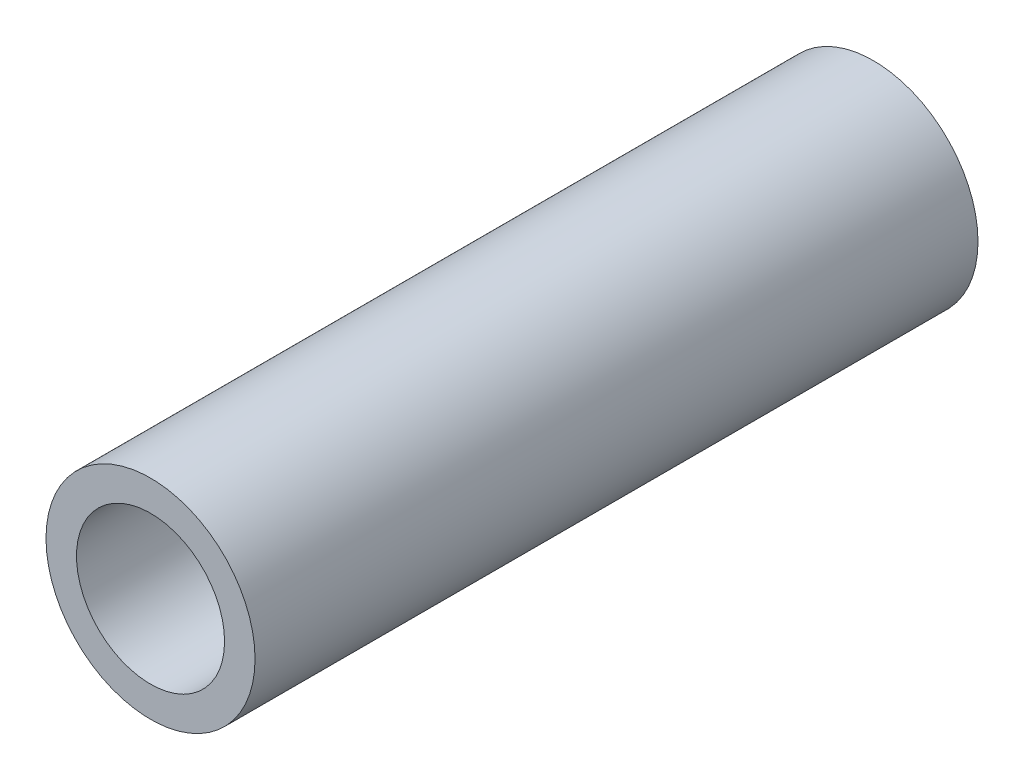
ISO-10303-21;
HEADER;
FILE_DESCRIPTION(('STEP AP214'),'2;1');
FILE_NAME('part.step','',(''),(''),'','','');
FILE_SCHEMA(('AUTOMOTIVE_DESIGN { 1 0 10303 214 1 1 1 1 }'));
ENDSEC;
DATA;
#1=APPLICATION_CONTEXT('core data for automotive mechanical design processes');
#2=APPLICATION_PROTOCOL_DEFINITION('international standard','automotive_design',2000,#1);
#3=PRODUCT_CONTEXT('',#1,'mechanical');
#4=PRODUCT('Part','Part','',(#3));
#5=PRODUCT_RELATED_PRODUCT_CATEGORY('part','',(#4));
#6=PRODUCT_DEFINITION_FORMATION('','',#4);
#7=PRODUCT_DEFINITION_CONTEXT('part definition',#1,'design');
#8=PRODUCT_DEFINITION('design','',#6,#7);
#9=PRODUCT_DEFINITION_SHAPE('','',#8);
#10=(LENGTH_UNIT() NAMED_UNIT(*) SI_UNIT(.MILLI.,.METRE.));
#11=(NAMED_UNIT(*) PLANE_ANGLE_UNIT() SI_UNIT($,.RADIAN.));
#12=(NAMED_UNIT(*) SI_UNIT($,.STERADIAN.) SOLID_ANGLE_UNIT());
#13=UNCERTAINTY_MEASURE_WITH_UNIT(LENGTH_MEASURE(1.E-05),#10,'distance_accuracy_value','');
#14=(GEOMETRIC_REPRESENTATION_CONTEXT(3) GLOBAL_UNCERTAINTY_ASSIGNED_CONTEXT((#13)) GLOBAL_UNIT_ASSIGNED_CONTEXT((#10,
#11,#12)) REPRESENTATION_CONTEXT('',''));
#15=CARTESIAN_POINT('',(0.,0.,0.));
#16=DIRECTION('',(0.,0.,1.));
#17=DIRECTION('',(1.,0.,0.));
#18=AXIS2_PLACEMENT_3D('',#15,#16,#17);
#19=CARTESIAN_POINT('',(0.,0.,41.5));
#20=DIRECTION('',(0.,0.,1.));
#21=DIRECTION('',(1.,0.,0.));
#22=AXIS2_PLACEMENT_3D('',#19,#20,#21);
#23=PLANE('',#22);
#24=CARTESIAN_POINT('',(0.,0.,41.5));
#25=DIRECTION('',(0.,0.,1.));
#26=DIRECTION('',(1.,0.,0.));
#27=AXIS2_PLACEMENT_3D('',#24,#25,#26);
#28=CIRCLE('',#27,12.);
#29=CARTESIAN_POINT('',(12.,0.,41.5));
#30=VERTEX_POINT('',#29);
#31=EDGE_CURVE('E10',#30,#30,#28,.T.);
#32=ORIENTED_EDGE('',*,*,#31,.T.);
#33=EDGE_LOOP('',(#32));
#34=FACE_BOUND('',#33,.T.);
#35=CARTESIAN_POINT('',(0.,0.,41.5));
#36=DIRECTION('',(0.,0.,1.));
#37=DIRECTION('',(1.,0.,0.));
#38=AXIS2_PLACEMENT_3D('',#35,#36,#37);
#39=CIRCLE('',#38,8.5);
#40=CARTESIAN_POINT('',(8.5,0.,41.5));
#41=VERTEX_POINT('',#40);
#42=EDGE_CURVE('E45',#41,#41,#39,.T.);
#43=ORIENTED_EDGE('',*,*,#42,.F.);
#44=EDGE_LOOP('',(#43));
#45=FACE_BOUND('',#44,.T.);
#46=ADVANCED_FACE('F34',(#34,#45),#23,.T.);
#47=CARTESIAN_POINT('',(0.,0.,-41.5));
#48=DIRECTION('',(0.,0.,1.));
#49=DIRECTION('',(1.,0.,0.));
#50=AXIS2_PLACEMENT_3D('',#47,#48,#49);
#51=PLANE('',#50);
#52=CARTESIAN_POINT('',(0.,0.,-41.5));
#53=DIRECTION('',(0.,0.,1.));
#54=DIRECTION('',(1.,0.,0.));
#55=AXIS2_PLACEMENT_3D('',#52,#53,#54);
#56=CIRCLE('',#55,12.);
#57=CARTESIAN_POINT('',(12.,0.,-41.5));
#58=VERTEX_POINT('',#57);
#59=EDGE_CURVE('E38',#58,#58,#56,.T.);
#60=ORIENTED_EDGE('',*,*,#59,.F.);
#61=EDGE_LOOP('',(#60));
#62=FACE_BOUND('',#61,.T.);
#63=CARTESIAN_POINT('',(0.,0.,-41.5));
#64=DIRECTION('',(0.,0.,1.));
#65=DIRECTION('',(1.,0.,0.));
#66=AXIS2_PLACEMENT_3D('',#63,#64,#65);
#67=CIRCLE('',#66,8.5);
#68=CARTESIAN_POINT('',(8.5,0.,-41.5));
#69=VERTEX_POINT('',#68);
#70=EDGE_CURVE('E47',#69,#69,#67,.T.);
#71=ORIENTED_EDGE('',*,*,#70,.T.);
#72=EDGE_LOOP('',(#71));
#73=FACE_BOUND('',#72,.T.);
#74=ADVANCED_FACE('F57',(#62,#73),#51,.F.);
#75=CARTESIAN_POINT('',(0.,0.,41.5));
#76=DIRECTION('',(0.,0.,-1.));
#77=DIRECTION('',(-1.,0.,0.));
#78=AXIS2_PLACEMENT_3D('',#75,#76,#77);
#79=CYLINDRICAL_SURFACE('',#78,12.);
#80=ORIENTED_EDGE('',*,*,#31,.F.);
#81=EDGE_LOOP('',(#80));
#82=FACE_BOUND('',#81,.T.);
#83=ORIENTED_EDGE('',*,*,#59,.T.);
#84=EDGE_LOOP('',(#83));
#85=FACE_BOUND('',#84,.T.);
#86=ADVANCED_FACE('F36',(#82,#85),#79,.T.);
#87=CARTESIAN_POINT('',(0.,0.,41.5));
#88=DIRECTION('',(0.,0.,-1.));
#89=DIRECTION('',(-1.,0.,0.));
#90=AXIS2_PLACEMENT_3D('',#87,#88,#89);
#91=CYLINDRICAL_SURFACE('',#90,8.5);
#92=ORIENTED_EDGE('',*,*,#42,.T.);
#93=EDGE_LOOP('',(#92));
#94=FACE_BOUND('',#93,.T.);
#95=ORIENTED_EDGE('',*,*,#70,.F.);
#96=EDGE_LOOP('',(#95));
#97=FACE_BOUND('',#96,.T.);
#98=ADVANCED_FACE('F53',(#94,#97),#91,.F.);
#99=CLOSED_SHELL('',(#46,#74,#86,#98));
#100=MANIFOLD_SOLID_BREP('B2',#99);
#101=ADVANCED_BREP_SHAPE_REPRESENTATION('',(#18,#100),#14);
#102=SHAPE_DEFINITION_REPRESENTATION(#9,#101);
ENDSEC;
END-ISO-10303-21;
